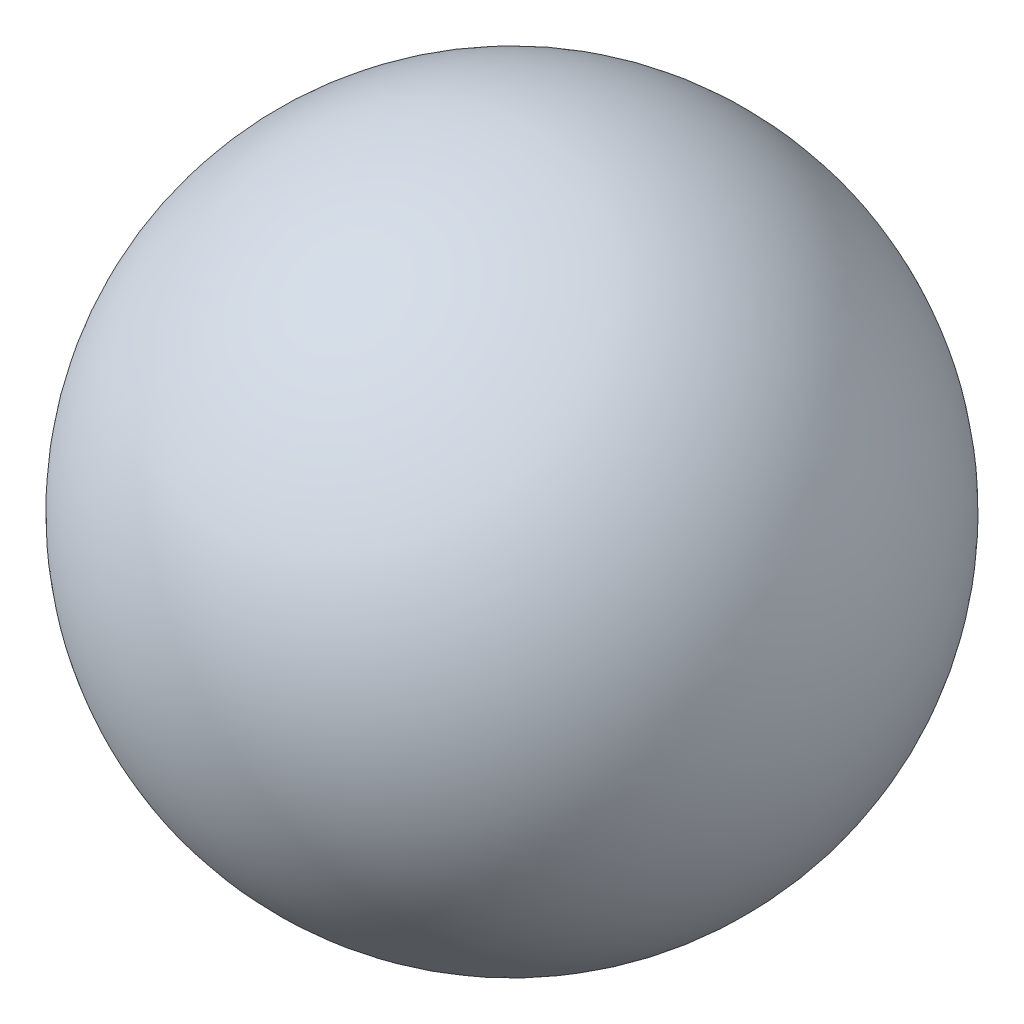
ISO-10303-21;
HEADER;
FILE_DESCRIPTION(('STEP AP214'),'2;1');
FILE_NAME('part.step','',(''),(''),'','','');
FILE_SCHEMA(('AUTOMOTIVE_DESIGN { 1 0 10303 214 1 1 1 1 }'));
ENDSEC;
DATA;
#1=APPLICATION_CONTEXT('core data for automotive mechanical design processes');
#2=APPLICATION_PROTOCOL_DEFINITION('international standard','automotive_design',2000,#1);
#3=PRODUCT_CONTEXT('',#1,'mechanical');
#4=PRODUCT('Part','Part','',(#3));
#5=PRODUCT_RELATED_PRODUCT_CATEGORY('part','',(#4));
#6=PRODUCT_DEFINITION_FORMATION('','',#4);
#7=PRODUCT_DEFINITION_CONTEXT('part definition',#1,'design');
#8=PRODUCT_DEFINITION('design','',#6,#7);
#9=PRODUCT_DEFINITION_SHAPE('','',#8);
#10=(LENGTH_UNIT() NAMED_UNIT(*) SI_UNIT(.MILLI.,.METRE.));
#11=(NAMED_UNIT(*) PLANE_ANGLE_UNIT() SI_UNIT($,.RADIAN.));
#12=(NAMED_UNIT(*) SI_UNIT($,.STERADIAN.) SOLID_ANGLE_UNIT());
#13=UNCERTAINTY_MEASURE_WITH_UNIT(LENGTH_MEASURE(1.E-05),#10,'distance_accuracy_value','');
#14=(GEOMETRIC_REPRESENTATION_CONTEXT(3) GLOBAL_UNCERTAINTY_ASSIGNED_CONTEXT((#13)) GLOBAL_UNIT_ASSIGNED_CONTEXT((#10,
#11,#12)) REPRESENTATION_CONTEXT('',''));
#15=CARTESIAN_POINT('',(0.,0.,0.));
#16=DIRECTION('',(0.,0.,1.));
#17=DIRECTION('',(1.,0.,0.));
#18=AXIS2_PLACEMENT_3D('',#15,#16,#17);
#19=CARTESIAN_POINT('',(0.,0.,0.));
#20=DIRECTION('',(0.,0.,-1.));
#21=DIRECTION('',(1.,0.,0.));
#22=AXIS2_PLACEMENT_3D('',#19,#20,#21);
#23=SPHERICAL_SURFACE('',#22,4.);
#24=CARTESIAN_POINT('',(0.,0.,-4.));
#25=VERTEX_POINT('',#24);
#26=VERTEX_LOOP('',#25);
#27=FACE_BOUND('',#26,.T.);
#28=ADVANCED_FACE('F37',(#27),#23,.T.);
#29=CLOSED_SHELL('',(#28));
#30=MANIFOLD_SOLID_BREP('B2',#29);
#31=ADVANCED_BREP_SHAPE_REPRESENTATION('',(#18,#30),#14);
#32=SHAPE_DEFINITION_REPRESENTATION(#9,#31);
ENDSEC;
END-ISO-10303-21;
